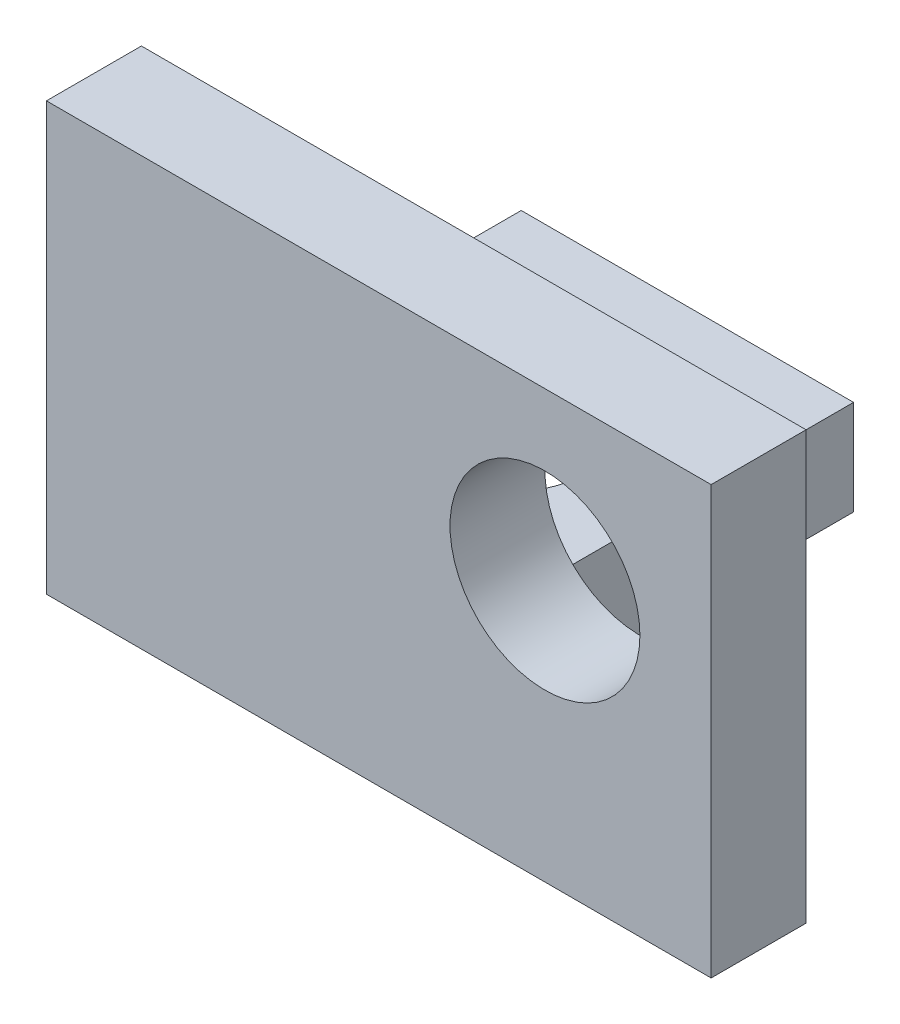
ISO-10303-21;
HEADER;
FILE_DESCRIPTION(('STEP AP214'),'2;1');
FILE_NAME('part.step','',(''),(''),'','','');
FILE_SCHEMA(('AUTOMOTIVE_DESIGN { 1 0 10303 214 1 1 1 1 }'));
ENDSEC;
DATA;
#1=APPLICATION_CONTEXT('core data for automotive mechanical design processes');
#2=APPLICATION_PROTOCOL_DEFINITION('international standard','automotive_design',2000,#1);
#3=PRODUCT_CONTEXT('',#1,'mechanical');
#4=PRODUCT('Part','Part','',(#3));
#5=PRODUCT_RELATED_PRODUCT_CATEGORY('part','',(#4));
#6=PRODUCT_DEFINITION_FORMATION('','',#4);
#7=PRODUCT_DEFINITION_CONTEXT('part definition',#1,'design');
#8=PRODUCT_DEFINITION('design','',#6,#7);
#9=PRODUCT_DEFINITION_SHAPE('','',#8);
#10=(LENGTH_UNIT() NAMED_UNIT(*) SI_UNIT(.MILLI.,.METRE.));
#11=(NAMED_UNIT(*) PLANE_ANGLE_UNIT() SI_UNIT($,.RADIAN.));
#12=(NAMED_UNIT(*) SI_UNIT($,.STERADIAN.) SOLID_ANGLE_UNIT());
#13=UNCERTAINTY_MEASURE_WITH_UNIT(LENGTH_MEASURE(1.E-05),#10,'distance_accuracy_value','');
#14=(GEOMETRIC_REPRESENTATION_CONTEXT(3) GLOBAL_UNCERTAINTY_ASSIGNED_CONTEXT((#13)) GLOBAL_UNIT_ASSIGNED_CONTEXT((#10,
#11,#12)) REPRESENTATION_CONTEXT('',''));
#15=CARTESIAN_POINT('',(0.,0.,0.));
#16=DIRECTION('',(0.,0.,1.));
#17=DIRECTION('',(1.,0.,0.));
#18=AXIS2_PLACEMENT_3D('',#15,#16,#17);
#19=CARTESIAN_POINT('',(0.,2.54,0.));
#20=DIRECTION('',(0.,-1.,0.));
#21=DIRECTION('',(0.,0.,-1.));
#22=AXIS2_PLACEMENT_3D('',#19,#20,#21);
#23=PLANE('',#22);
#24=DIRECTION('',(0.,0.,1.));
#25=VECTOR('',#24,1.);
#26=CARTESIAN_POINT('',(-8.89,2.54,0.));
#27=LINE('',#26,#25);
#28=CARTESIAN_POINT('',(-8.89,2.54,0.));
#29=VERTEX_POINT('',#28);
#30=CARTESIAN_POINT('',(-8.89,2.54,10.16));
#31=VERTEX_POINT('',#30);
#32=EDGE_CURVE('E145',#29,#31,#27,.T.);
#33=ORIENTED_EDGE('',*,*,#32,.T.);
#34=DIRECTION('',(1.,0.,0.));
#35=VECTOR('',#34,1.);
#36=CARTESIAN_POINT('',(0.,2.54,10.16));
#37=LINE('',#36,#35);
#38=CARTESIAN_POINT('',(0.,2.54,10.16));
#39=VERTEX_POINT('',#38);
#40=EDGE_CURVE('E49',#31,#39,#37,.T.);
#41=ORIENTED_EDGE('',*,*,#40,.T.);
#42=DIRECTION('',(0.,0.,-1.));
#43=VECTOR('',#42,1.);
#44=CARTESIAN_POINT('',(0.,2.54,0.));
#45=LINE('',#44,#43);
#46=CARTESIAN_POINT('',(0.,2.54,0.));
#47=VERTEX_POINT('',#46);
#48=EDGE_CURVE('E140',#39,#47,#45,.T.);
#49=ORIENTED_EDGE('',*,*,#48,.T.);
#50=DIRECTION('',(-1.,0.,0.));
#51=VECTOR('',#50,1.);
#52=CARTESIAN_POINT('',(0.,2.54,0.));
#53=LINE('',#52,#51);
#54=EDGE_CURVE('E142',#47,#29,#53,.T.);
#55=ORIENTED_EDGE('',*,*,#54,.T.);
#56=EDGE_LOOP('',(#33,#41,#49,#55));
#57=FACE_BOUND('',#56,.T.);
#58=CARTESIAN_POINT('',(-4.445,2.54,5.08));
#59=DIRECTION('',(0.,1.,0.));
#60=DIRECTION('',(0.,0.,1.));
#61=AXIS2_PLACEMENT_3D('',#58,#59,#60);
#62=CIRCLE('',#61,2.54);
#63=CARTESIAN_POINT('',(-4.445,2.54,7.62));
#64=VERTEX_POINT('',#63);
#65=EDGE_CURVE('E135',#64,#64,#62,.T.);
#66=ORIENTED_EDGE('',*,*,#65,.F.);
#67=EDGE_LOOP('',(#66));
#68=FACE_BOUND('',#67,.T.);
#69=ADVANCED_FACE('F34',(#57,#68),#23,.F.);
#70=CARTESIAN_POINT('',(0.,0.,0.));
#71=DIRECTION('',(0.,-1.,0.));
#72=DIRECTION('',(0.,0.,-1.));
#73=AXIS2_PLACEMENT_3D('',#70,#71,#72);
#74=PLANE('',#73);
#75=DIRECTION('',(0.,0.,-1.));
#76=VECTOR('',#75,1.);
#77=CARTESIAN_POINT('',(0.,0.,0.));
#78=LINE('',#77,#76);
#79=CARTESIAN_POINT('',(0.,0.,10.16));
#80=VERTEX_POINT('',#79);
#81=CARTESIAN_POINT('',(0.,0.,0.));
#82=VERTEX_POINT('',#81);
#83=EDGE_CURVE('E101',#80,#82,#78,.T.);
#84=ORIENTED_EDGE('',*,*,#83,.F.);
#85=DIRECTION('',(1.,0.,0.));
#86=VECTOR('',#85,1.);
#87=CARTESIAN_POINT('',(-8.89,0.,10.16));
#88=LINE('',#87,#86);
#89=CARTESIAN_POINT('',(8.89,0.,10.16));
#90=VERTEX_POINT('',#89);
#91=EDGE_CURVE('E93',#80,#90,#88,.T.);
#92=ORIENTED_EDGE('',*,*,#91,.T.);
#93=DIRECTION('',(0.,0.,1.));
#94=VECTOR('',#93,1.);
#95=CARTESIAN_POINT('',(8.89,0.,10.16));
#96=LINE('',#95,#94);
#97=CARTESIAN_POINT('',(8.89,0.,12.7));
#98=VERTEX_POINT('',#97);
#99=EDGE_CURVE('E98',#90,#98,#96,.T.);
#100=ORIENTED_EDGE('',*,*,#99,.T.);
#101=DIRECTION('',(1.,0.,0.));
#102=VECTOR('',#101,1.);
#103=CARTESIAN_POINT('',(0.,0.,12.7));
#104=LINE('',#103,#102);
#105=CARTESIAN_POINT('',(-8.89,0.,12.7));
#106=VERTEX_POINT('',#105);
#107=EDGE_CURVE('E143',#106,#98,#104,.T.);
#108=ORIENTED_EDGE('',*,*,#107,.F.);
#109=DIRECTION('',(0.,0.,1.));
#110=VECTOR('',#109,1.);
#111=CARTESIAN_POINT('',(-8.89,0.,0.));
#112=LINE('',#111,#110);
#113=CARTESIAN_POINT('',(-8.89,0.,0.));
#114=VERTEX_POINT('',#113);
#115=EDGE_CURVE('E151',#114,#106,#112,.T.);
#116=ORIENTED_EDGE('',*,*,#115,.F.);
#117=DIRECTION('',(-1.,0.,0.));
#118=VECTOR('',#117,1.);
#119=CARTESIAN_POINT('',(0.,0.,0.));
#120=LINE('',#119,#118);
#121=EDGE_CURVE('E149',#82,#114,#120,.T.);
#122=ORIENTED_EDGE('',*,*,#121,.F.);
#123=EDGE_LOOP('',(#84,#92,#100,#108,#116,#122));
#124=FACE_BOUND('',#123,.T.);
#125=CARTESIAN_POINT('',(-4.445,0.,5.08));
#126=DIRECTION('',(0.,1.,0.));
#127=DIRECTION('',(0.,0.,1.));
#128=AXIS2_PLACEMENT_3D('',#125,#126,#127);
#129=CIRCLE('',#128,2.54);
#130=CARTESIAN_POINT('',(-4.445,0.,7.62));
#131=VERTEX_POINT('',#130);
#132=EDGE_CURVE('E134',#131,#131,#129,.T.);
#133=ORIENTED_EDGE('',*,*,#132,.T.);
#134=EDGE_LOOP('',(#133));
#135=FACE_BOUND('',#134,.T.);
#136=ADVANCED_FACE('F95',(#124,#135),#74,.T.);
#137=CARTESIAN_POINT('',(0.,2.54,0.));
#138=DIRECTION('',(-1.,0.,0.));
#139=DIRECTION('',(0.,0.,1.));
#140=AXIS2_PLACEMENT_3D('',#137,#138,#139);
#141=PLANE('',#140);
#142=ORIENTED_EDGE('',*,*,#48,.F.);
#143=DIRECTION('',(0.,-1.,0.));
#144=VECTOR('',#143,1.);
#145=CARTESIAN_POINT('',(0.,2.54,10.16));
#146=LINE('',#145,#144);
#147=EDGE_CURVE('E56',#39,#80,#146,.T.);
#148=ORIENTED_EDGE('',*,*,#147,.T.);
#149=ORIENTED_EDGE('',*,*,#83,.T.);
#150=DIRECTION('',(0.,-1.,0.));
#151=VECTOR('',#150,1.);
#152=CARTESIAN_POINT('',(0.,2.54,0.));
#153=LINE('',#152,#151);
#154=EDGE_CURVE('E11',#47,#82,#153,.T.);
#155=ORIENTED_EDGE('',*,*,#154,.F.);
#156=EDGE_LOOP('',(#142,#148,#149,#155));
#157=FACE_BOUND('',#156,.T.);
#158=ADVANCED_FACE('F36',(#157),#141,.F.);
#159=CARTESIAN_POINT('',(0.,2.54,0.));
#160=DIRECTION('',(0.,0.,1.));
#161=DIRECTION('',(1.,0.,0.));
#162=AXIS2_PLACEMENT_3D('',#159,#160,#161);
#163=PLANE('',#162);
#164=ORIENTED_EDGE('',*,*,#121,.T.);
#165=DIRECTION('',(0.,-1.,0.));
#166=VECTOR('',#165,1.);
#167=CARTESIAN_POINT('',(-8.89,2.54,0.));
#168=LINE('',#167,#166);
#169=EDGE_CURVE('E42',#29,#114,#168,.T.);
#170=ORIENTED_EDGE('',*,*,#169,.F.);
#171=ORIENTED_EDGE('',*,*,#54,.F.);
#172=ORIENTED_EDGE('',*,*,#154,.T.);
#173=EDGE_LOOP('',(#164,#170,#171,#172));
#174=FACE_BOUND('',#173,.T.);
#175=ADVANCED_FACE('F193',(#174),#163,.F.);
#176=CARTESIAN_POINT('',(-8.89,2.54,0.));
#177=DIRECTION('',(1.,0.,0.));
#178=DIRECTION('',(0.,0.,-1.));
#179=AXIS2_PLACEMENT_3D('',#176,#177,#178);
#180=PLANE('',#179);
#181=ORIENTED_EDGE('',*,*,#115,.T.);
#182=DIRECTION('',(0.,-1.,0.));
#183=VECTOR('',#182,1.);
#184=CARTESIAN_POINT('',(-8.89,2.54,12.7));
#185=LINE('',#184,#183);
#186=CARTESIAN_POINT('',(-8.89,11.43,12.7));
#187=VERTEX_POINT('',#186);
#188=EDGE_CURVE('E147',#187,#106,#185,.T.);
#189=ORIENTED_EDGE('',*,*,#188,.F.);
#190=DIRECTION('',(0.,0.,1.));
#191=VECTOR('',#190,1.);
#192=CARTESIAN_POINT('',(-8.89,11.43,10.16));
#193=LINE('',#192,#191);
#194=CARTESIAN_POINT('',(-8.89,11.43,10.16));
#195=VERTEX_POINT('',#194);
#196=EDGE_CURVE('E128',#195,#187,#193,.T.);
#197=ORIENTED_EDGE('',*,*,#196,.F.);
#198=DIRECTION('',(0.,-1.,0.));
#199=VECTOR('',#198,1.);
#200=CARTESIAN_POINT('',(-8.89,0.,10.16));
#201=LINE('',#200,#199);
#202=EDGE_CURVE('E105',#195,#31,#201,.T.);
#203=ORIENTED_EDGE('',*,*,#202,.T.);
#204=ORIENTED_EDGE('',*,*,#32,.F.);
#205=ORIENTED_EDGE('',*,*,#169,.T.);
#206=EDGE_LOOP('',(#181,#189,#197,#203,#204,#205));
#207=FACE_BOUND('',#206,.T.);
#208=ADVANCED_FACE('F160',(#207),#180,.F.);
#209=CARTESIAN_POINT('',(0.,2.54,12.7));
#210=DIRECTION('',(0.,0.,-1.));
#211=DIRECTION('',(-1.,0.,0.));
#212=AXIS2_PLACEMENT_3D('',#209,#210,#211);
#213=PLANE('',#212);
#214=ORIENTED_EDGE('',*,*,#107,.T.);
#215=DIRECTION('',(0.,1.,0.));
#216=VECTOR('',#215,1.);
#217=CARTESIAN_POINT('',(8.89,0.,12.7));
#218=LINE('',#217,#216);
#219=CARTESIAN_POINT('',(8.89,11.43,12.7));
#220=VERTEX_POINT('',#219);
#221=EDGE_CURVE('E112',#98,#220,#218,.T.);
#222=ORIENTED_EDGE('',*,*,#221,.T.);
#223=DIRECTION('',(-1.,0.,0.));
#224=VECTOR('',#223,1.);
#225=CARTESIAN_POINT('',(-8.89,11.43,12.7));
#226=LINE('',#225,#224);
#227=EDGE_CURVE('E124',#220,#187,#226,.T.);
#228=ORIENTED_EDGE('',*,*,#227,.T.);
#229=ORIENTED_EDGE('',*,*,#188,.T.);
#230=EDGE_LOOP('',(#214,#222,#228,#229));
#231=FACE_BOUND('',#230,.T.);
#232=CARTESIAN_POINT('',(4.445,6.985,12.7));
#233=DIRECTION('',(0.,0.,1.));
#234=DIRECTION('',(1.,0.,0.));
#235=AXIS2_PLACEMENT_3D('',#232,#233,#234);
#236=CIRCLE('',#235,2.54);
#237=CARTESIAN_POINT('',(6.985,6.985,12.7));
#238=VERTEX_POINT('',#237);
#239=EDGE_CURVE('E200',#238,#238,#236,.T.);
#240=ORIENTED_EDGE('',*,*,#239,.F.);
#241=EDGE_LOOP('',(#240));
#242=FACE_BOUND('',#241,.T.);
#243=ADVANCED_FACE('F165',(#231,#242),#213,.F.);
#244=CARTESIAN_POINT('',(-4.445,2.54,5.08));
#245=DIRECTION('',(0.,-1.,0.));
#246=DIRECTION('',(0.,0.,-1.));
#247=AXIS2_PLACEMENT_3D('',#244,#245,#246);
#248=CYLINDRICAL_SURFACE('',#247,2.54);
#249=ORIENTED_EDGE('',*,*,#65,.T.);
#250=EDGE_LOOP('',(#249));
#251=FACE_BOUND('',#250,.T.);
#252=ORIENTED_EDGE('',*,*,#132,.F.);
#253=EDGE_LOOP('',(#252));
#254=FACE_BOUND('',#253,.T.);
#255=ADVANCED_FACE('F178',(#251,#254),#248,.F.);
#256=CARTESIAN_POINT('',(0.,0.,10.16));
#257=DIRECTION('',(0.,0.,-1.));
#258=DIRECTION('',(-1.,0.,0.));
#259=AXIS2_PLACEMENT_3D('',#256,#257,#258);
#260=PLANE('',#259);
#261=CARTESIAN_POINT('',(4.445,6.985,10.16));
#262=DIRECTION('',(0.,0.,1.));
#263=DIRECTION('',(1.,0.,0.));
#264=AXIS2_PLACEMENT_3D('',#261,#262,#263);
#265=CIRCLE('',#264,2.54);
#266=CARTESIAN_POINT('',(6.985,6.985,10.16));
#267=VERTEX_POINT('',#266);
#268=EDGE_CURVE('E125',#267,#267,#265,.T.);
#269=ORIENTED_EDGE('',*,*,#268,.T.);
#270=EDGE_LOOP('',(#269));
#271=FACE_BOUND('',#270,.T.);
#272=ORIENTED_EDGE('',*,*,#40,.F.);
#273=ORIENTED_EDGE('',*,*,#202,.F.);
#274=DIRECTION('',(-1.,0.,0.));
#275=VECTOR('',#274,1.);
#276=CARTESIAN_POINT('',(-8.89,11.43,10.16));
#277=LINE('',#276,#275);
#278=CARTESIAN_POINT('',(8.89,11.43,10.16));
#279=VERTEX_POINT('',#278);
#280=EDGE_CURVE('E114',#279,#195,#277,.T.);
#281=ORIENTED_EDGE('',*,*,#280,.F.);
#282=DIRECTION('',(0.,1.,0.));
#283=VECTOR('',#282,1.);
#284=CARTESIAN_POINT('',(8.89,0.,10.16));
#285=LINE('',#284,#283);
#286=EDGE_CURVE('E104',#90,#279,#285,.T.);
#287=ORIENTED_EDGE('',*,*,#286,.F.);
#288=ORIENTED_EDGE('',*,*,#91,.F.);
#289=ORIENTED_EDGE('',*,*,#147,.F.);
#290=EDGE_LOOP('',(#272,#273,#281,#287,#288,#289));
#291=FACE_BOUND('',#290,.T.);
#292=ADVANCED_FACE('F116',(#271,#291),#260,.T.);
#293=CARTESIAN_POINT('',(-8.89,11.43,10.16));
#294=DIRECTION('',(0.,1.,0.));
#295=DIRECTION('',(0.,0.,1.));
#296=AXIS2_PLACEMENT_3D('',#293,#294,#295);
#297=PLANE('',#296);
#298=ORIENTED_EDGE('',*,*,#227,.F.);
#299=DIRECTION('',(0.,0.,1.));
#300=VECTOR('',#299,1.);
#301=CARTESIAN_POINT('',(8.89,11.43,10.16));
#302=LINE('',#301,#300);
#303=EDGE_CURVE('E113',#279,#220,#302,.T.);
#304=ORIENTED_EDGE('',*,*,#303,.F.);
#305=ORIENTED_EDGE('',*,*,#280,.T.);
#306=ORIENTED_EDGE('',*,*,#196,.T.);
#307=EDGE_LOOP('',(#298,#304,#305,#306));
#308=FACE_BOUND('',#307,.T.);
#309=ADVANCED_FACE('F169',(#308),#297,.T.);
#310=CARTESIAN_POINT('',(8.89,0.,10.16));
#311=DIRECTION('',(1.,0.,0.));
#312=DIRECTION('',(0.,1.,0.));
#313=AXIS2_PLACEMENT_3D('',#310,#311,#312);
#314=PLANE('',#313);
#315=ORIENTED_EDGE('',*,*,#221,.F.);
#316=ORIENTED_EDGE('',*,*,#99,.F.);
#317=ORIENTED_EDGE('',*,*,#286,.T.);
#318=ORIENTED_EDGE('',*,*,#303,.T.);
#319=EDGE_LOOP('',(#315,#316,#317,#318));
#320=FACE_BOUND('',#319,.T.);
#321=ADVANCED_FACE('F109',(#320),#314,.T.);
#322=CARTESIAN_POINT('',(4.445,6.985,10.16));
#323=DIRECTION('',(0.,0.,1.));
#324=DIRECTION('',(1.,0.,0.));
#325=AXIS2_PLACEMENT_3D('',#322,#323,#324);
#326=CYLINDRICAL_SURFACE('',#325,2.54);
#327=ORIENTED_EDGE('',*,*,#268,.F.);
#328=EDGE_LOOP('',(#327));
#329=FACE_BOUND('',#328,.T.);
#330=ORIENTED_EDGE('',*,*,#239,.T.);
#331=EDGE_LOOP('',(#330));
#332=FACE_BOUND('',#331,.T.);
#333=ADVANCED_FACE('F176',(#329,#332),#326,.F.);
#334=CLOSED_SHELL('',(#69,#136,#158,#175,#208,#243,#255,#292,#309,#321,#333));
#335=MANIFOLD_SOLID_BREP('B2',#334);
#336=ADVANCED_BREP_SHAPE_REPRESENTATION('',(#18,#335),#14);
#337=SHAPE_DEFINITION_REPRESENTATION(#9,#336);
ENDSEC;
END-ISO-10303-21;
